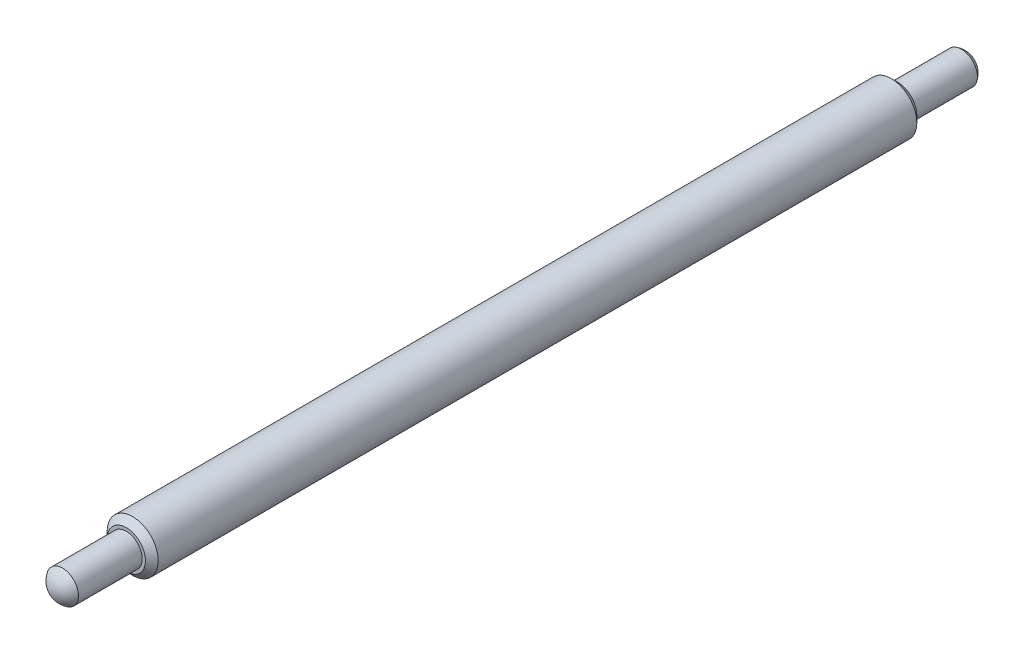
ISO-10303-21;
HEADER;
FILE_DESCRIPTION(('STEP AP214'),'2;1');
FILE_NAME('part.step','',(''),(''),'','','');
FILE_SCHEMA(('AUTOMOTIVE_DESIGN { 1 0 10303 214 1 1 1 1 }'));
ENDSEC;
DATA;
#1=APPLICATION_CONTEXT('core data for automotive mechanical design processes');
#2=APPLICATION_PROTOCOL_DEFINITION('international standard','automotive_design',2000,#1);
#3=PRODUCT_CONTEXT('',#1,'mechanical');
#4=PRODUCT('Part','Part','',(#3));
#5=PRODUCT_RELATED_PRODUCT_CATEGORY('part','',(#4));
#6=PRODUCT_DEFINITION_FORMATION('','',#4);
#7=PRODUCT_DEFINITION_CONTEXT('part definition',#1,'design');
#8=PRODUCT_DEFINITION('design','',#6,#7);
#9=PRODUCT_DEFINITION_SHAPE('','',#8);
#10=(LENGTH_UNIT() NAMED_UNIT(*) SI_UNIT(.MILLI.,.METRE.));
#11=(NAMED_UNIT(*) PLANE_ANGLE_UNIT() SI_UNIT($,.RADIAN.));
#12=(NAMED_UNIT(*) SI_UNIT($,.STERADIAN.) SOLID_ANGLE_UNIT());
#13=UNCERTAINTY_MEASURE_WITH_UNIT(LENGTH_MEASURE(1.E-05),#10,'distance_accuracy_value','');
#14=(GEOMETRIC_REPRESENTATION_CONTEXT(3) GLOBAL_UNCERTAINTY_ASSIGNED_CONTEXT((#13)) GLOBAL_UNIT_ASSIGNED_CONTEXT((#10,
#11,#12)) REPRESENTATION_CONTEXT('',''));
#15=CARTESIAN_POINT('',(0.,0.,0.));
#16=DIRECTION('',(0.,0.,1.));
#17=DIRECTION('',(1.,0.,0.));
#18=AXIS2_PLACEMENT_3D('',#15,#16,#17);
#19=CARTESIAN_POINT('',(0.,0.,-64.7339285714286));
#20=DIRECTION('',(0.,0.,-1.));
#21=DIRECTION('',(0.,-1.,0.));
#22=AXIS2_PLACEMENT_3D('',#19,#20,#21);
#23=SPHERICAL_SURFACE('',#22,1.46607142857143);
#24=CARTESIAN_POINT('',(0.,0.,-65.5));
#25=DIRECTION('',(0.,0.,-1.));
#26=DIRECTION('',(-1.,0.,0.));
#27=AXIS2_PLACEMENT_3D('',#24,#25,#26);
#28=CIRCLE('',#27,1.25);
#29=CARTESIAN_POINT('',(-1.25,0.,-65.5));
#30=VERTEX_POINT('',#29);
#31=EDGE_CURVE('E84',#30,#30,#28,.T.);
#32=ORIENTED_EDGE('',*,*,#31,.T.);
#33=EDGE_LOOP('',(#32));
#34=FACE_BOUND('',#33,.T.);
#35=ADVANCED_FACE('F48',(#34),#23,.T.);
#36=CARTESIAN_POINT('',(0.,0.,4.2339285714286));
#37=DIRECTION('',(0.,0.,-1.));
#38=DIRECTION('',(0.,1.,0.));
#39=AXIS2_PLACEMENT_3D('',#36,#37,#38);
#40=SPHERICAL_SURFACE('',#39,1.46607142857141);
#41=CARTESIAN_POINT('',(0.,0.,5.));
#42=DIRECTION('',(0.,0.,-1.));
#43=DIRECTION('',(-1.,0.,0.));
#44=AXIS2_PLACEMENT_3D('',#41,#42,#43);
#45=CIRCLE('',#44,1.25);
#46=CARTESIAN_POINT('',(-1.25,0.,5.));
#47=VERTEX_POINT('',#46);
#48=EDGE_CURVE('E74',#47,#47,#45,.T.);
#49=ORIENTED_EDGE('',*,*,#48,.F.);
#50=EDGE_LOOP('',(#49));
#51=FACE_BOUND('',#50,.T.);
#52=ADVANCED_FACE('F108',(#51),#40,.T.);
#53=CARTESIAN_POINT('',(0.,0.,-65.5));
#54=DIRECTION('',(0.,0.,-1.));
#55=DIRECTION('',(-1.,0.,0.));
#56=AXIS2_PLACEMENT_3D('',#53,#54,#55);
#57=CYLINDRICAL_SURFACE('',#56,1.25);
#58=CARTESIAN_POINT('',(0.,0.,0.));
#59=DIRECTION('',(0.,0.,-1.));
#60=DIRECTION('',(-1.,0.,0.));
#61=AXIS2_PLACEMENT_3D('',#58,#59,#60);
#62=CIRCLE('',#61,1.25);
#63=CARTESIAN_POINT('',(-1.25,0.,0.));
#64=VERTEX_POINT('',#63);
#65=EDGE_CURVE('E77',#64,#64,#62,.T.);
#66=ORIENTED_EDGE('',*,*,#65,.F.);
#67=EDGE_LOOP('',(#66));
#68=FACE_BOUND('',#67,.T.);
#69=ORIENTED_EDGE('',*,*,#48,.T.);
#70=EDGE_LOOP('',(#69));
#71=FACE_BOUND('',#70,.T.);
#72=ADVANCED_FACE('F113',(#68,#71),#57,.T.);
#73=CARTESIAN_POINT('',(0.,-2.,0.));
#74=DIRECTION('',(0.,0.,-1.));
#75=DIRECTION('',(-1.,0.,0.));
#76=AXIS2_PLACEMENT_3D('',#73,#74,#75);
#77=PLANE('',#76);
#78=CARTESIAN_POINT('',(0.,0.,0.));
#79=DIRECTION('',(0.,0.,-1.));
#80=DIRECTION('',(-1.,0.,0.));
#81=AXIS2_PLACEMENT_3D('',#78,#79,#80);
#82=CIRCLE('',#81,1.49999999999999);
#83=CARTESIAN_POINT('',(-1.49999999999999,0.,0.));
#84=VERTEX_POINT('',#83);
#85=EDGE_CURVE('E12',#84,#84,#82,.F.);
#86=ORIENTED_EDGE('',*,*,#85,.T.);
#87=EDGE_LOOP('',(#86));
#88=FACE_BOUND('',#87,.T.);
#89=ORIENTED_EDGE('',*,*,#65,.T.);
#90=EDGE_LOOP('',(#89));
#91=FACE_BOUND('',#90,.T.);
#92=ADVANCED_FACE('F105',(#88,#91),#77,.F.);
#93=CARTESIAN_POINT('',(0.,0.,-65.5));
#94=DIRECTION('',(0.,0.,-1.));
#95=DIRECTION('',(-1.,0.,0.));
#96=AXIS2_PLACEMENT_3D('',#93,#94,#95);
#97=CYLINDRICAL_SURFACE('',#96,2.);
#98=CARTESIAN_POINT('',(0.,0.,-60.));
#99=DIRECTION('',(0.,0.,1.));
#100=DIRECTION('',(1.,0.,0.));
#101=AXIS2_PLACEMENT_3D('',#98,#99,#100);
#102=CIRCLE('',#101,2.);
#103=CARTESIAN_POINT('',(2.,0.,-60.));
#104=VERTEX_POINT('',#103);
#105=EDGE_CURVE('E56',#104,#104,#102,.T.);
#106=ORIENTED_EDGE('',*,*,#105,.T.);
#107=EDGE_LOOP('',(#106));
#108=FACE_BOUND('',#107,.T.);
#109=CARTESIAN_POINT('',(0.,0.,-0.5));
#110=DIRECTION('',(0.,0.,-1.));
#111=DIRECTION('',(-1.,0.,0.));
#112=AXIS2_PLACEMENT_3D('',#109,#110,#111);
#113=CIRCLE('',#112,2.);
#114=CARTESIAN_POINT('',(-2.,0.,-0.5));
#115=VERTEX_POINT('',#114);
#116=EDGE_CURVE('E63',#115,#115,#113,.T.);
#117=ORIENTED_EDGE('',*,*,#116,.T.);
#118=EDGE_LOOP('',(#117));
#119=FACE_BOUND('',#118,.T.);
#120=ADVANCED_FACE('F99',(#108,#119),#97,.T.);
#121=CARTESIAN_POINT('',(0.,-1.25,-60.5));
#122=DIRECTION('',(0.,0.,1.));
#123=DIRECTION('',(1.,0.,0.));
#124=AXIS2_PLACEMENT_3D('',#121,#122,#123);
#125=PLANE('',#124);
#126=CARTESIAN_POINT('',(0.,0.,-60.5));
#127=DIRECTION('',(0.,0.,1.));
#128=DIRECTION('',(1.,0.,0.));
#129=AXIS2_PLACEMENT_3D('',#126,#127,#128);
#130=CIRCLE('',#129,1.49999999999999);
#131=CARTESIAN_POINT('',(1.49999999999999,0.,-60.5));
#132=VERTEX_POINT('',#131);
#133=EDGE_CURVE('E69',#132,#132,#130,.F.);
#134=ORIENTED_EDGE('',*,*,#133,.T.);
#135=EDGE_LOOP('',(#134));
#136=FACE_BOUND('',#135,.T.);
#137=CARTESIAN_POINT('',(0.,0.,-60.5));
#138=DIRECTION('',(0.,0.,-1.));
#139=DIRECTION('',(-1.,0.,0.));
#140=AXIS2_PLACEMENT_3D('',#137,#138,#139);
#141=CIRCLE('',#140,1.25);
#142=CARTESIAN_POINT('',(-1.25,0.,-60.5));
#143=VERTEX_POINT('',#142);
#144=EDGE_CURVE('E80',#143,#143,#141,.T.);
#145=ORIENTED_EDGE('',*,*,#144,.F.);
#146=EDGE_LOOP('',(#145));
#147=FACE_BOUND('',#146,.T.);
#148=ADVANCED_FACE('F94',(#136,#147),#125,.F.);
#149=CARTESIAN_POINT('',(0.,0.,-65.5));
#150=DIRECTION('',(0.,0.,-1.));
#151=DIRECTION('',(-1.,0.,0.));
#152=AXIS2_PLACEMENT_3D('',#149,#150,#151);
#153=CYLINDRICAL_SURFACE('',#152,1.25);
#154=ORIENTED_EDGE('',*,*,#31,.F.);
#155=EDGE_LOOP('',(#154));
#156=FACE_BOUND('',#155,.T.);
#157=ORIENTED_EDGE('',*,*,#144,.T.);
#158=EDGE_LOOP('',(#157));
#159=FACE_BOUND('',#158,.T.);
#160=ADVANCED_FACE('F90',(#156,#159),#153,.T.);
#161=CARTESIAN_POINT('',(0.,0.,-60.5));
#162=DIRECTION('',(0.,0.,1.));
#163=DIRECTION('',(1.,0.,0.));
#164=AXIS2_PLACEMENT_3D('',#161,#162,#163);
#165=CONICAL_SURFACE('',#164,1.49999999999999,0.785398163397442);
#166=ORIENTED_EDGE('',*,*,#105,.F.);
#167=EDGE_LOOP('',(#166));
#168=FACE_BOUND('',#167,.T.);
#169=ORIENTED_EDGE('',*,*,#133,.F.);
#170=EDGE_LOOP('',(#169));
#171=FACE_BOUND('',#170,.T.);
#172=ADVANCED_FACE('F93',(#168,#171),#165,.T.);
#173=CARTESIAN_POINT('',(0.,0.,-0.5));
#174=DIRECTION('',(0.,0.,-1.));
#175=DIRECTION('',(-1.,0.,0.));
#176=AXIS2_PLACEMENT_3D('',#173,#174,#175);
#177=CONICAL_SURFACE('',#176,2.,0.785398163397456);
#178=ORIENTED_EDGE('',*,*,#85,.F.);
#179=EDGE_LOOP('',(#178));
#180=FACE_BOUND('',#179,.T.);
#181=ORIENTED_EDGE('',*,*,#116,.F.);
#182=EDGE_LOOP('',(#181));
#183=FACE_BOUND('',#182,.T.);
#184=ADVANCED_FACE('F50',(#180,#183),#177,.T.);
#185=CLOSED_SHELL('',(#35,#52,#72,#92,#120,#148,#160,#172,#184));
#186=MANIFOLD_SOLID_BREP('B2',#185);
#187=ADVANCED_BREP_SHAPE_REPRESENTATION('',(#18,#186),#14);
#188=SHAPE_DEFINITION_REPRESENTATION(#9,#187);
ENDSEC;
END-ISO-10303-21;
